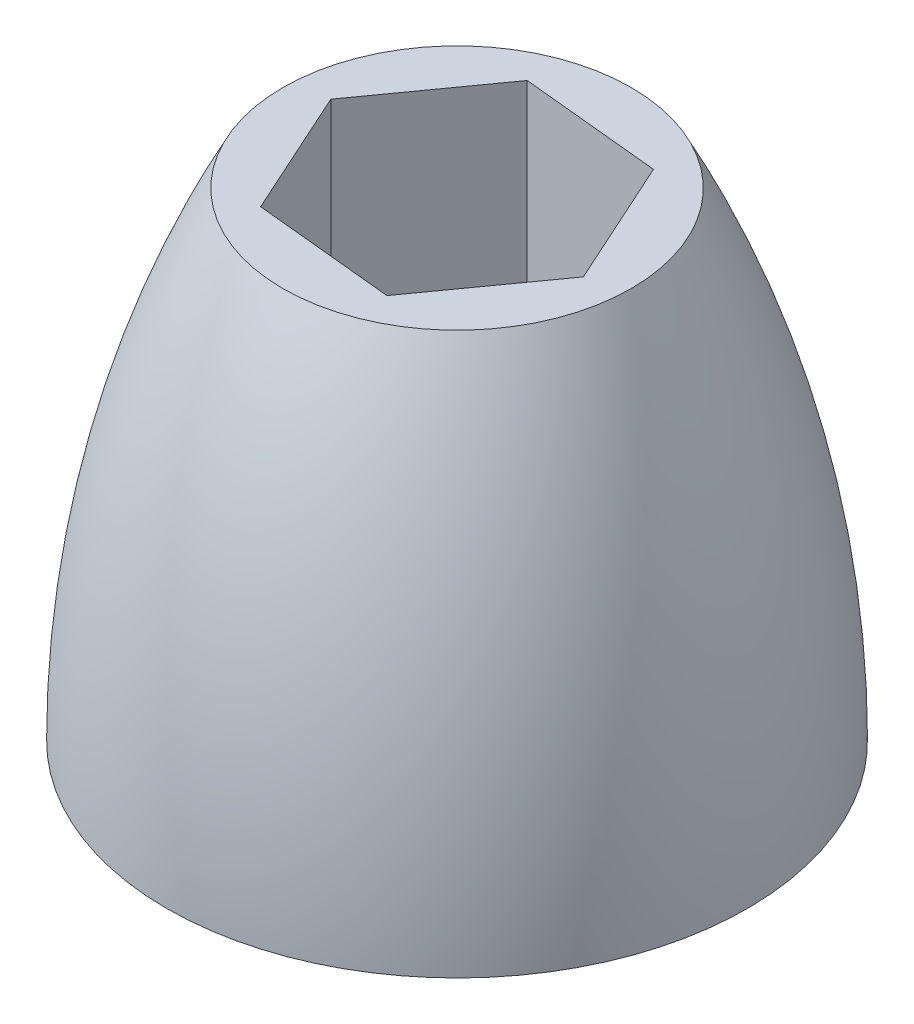
ISO-10303-21;
HEADER;
FILE_DESCRIPTION(('STEP AP214'),'2;1');
FILE_NAME('part.step','',(''),(''),'','','');
FILE_SCHEMA(('AUTOMOTIVE_DESIGN { 1 0 10303 214 1 1 1 1 }'));
ENDSEC;
DATA;
#1=APPLICATION_CONTEXT('core data for automotive mechanical design processes');
#2=APPLICATION_PROTOCOL_DEFINITION('international standard','automotive_design',2000,#1);
#3=PRODUCT_CONTEXT('',#1,'mechanical');
#4=PRODUCT('Part','Part','',(#3));
#5=PRODUCT_RELATED_PRODUCT_CATEGORY('part','',(#4));
#6=PRODUCT_DEFINITION_FORMATION('','',#4);
#7=PRODUCT_DEFINITION_CONTEXT('part definition',#1,'design');
#8=PRODUCT_DEFINITION('design','',#6,#7);
#9=PRODUCT_DEFINITION_SHAPE('','',#8);
#10=(LENGTH_UNIT() NAMED_UNIT(*) SI_UNIT(.MILLI.,.METRE.));
#11=(NAMED_UNIT(*) PLANE_ANGLE_UNIT() SI_UNIT($,.RADIAN.));
#12=(NAMED_UNIT(*) SI_UNIT($,.STERADIAN.) SOLID_ANGLE_UNIT());
#13=UNCERTAINTY_MEASURE_WITH_UNIT(LENGTH_MEASURE(1.E-05),#10,'distance_accuracy_value','');
#14=(GEOMETRIC_REPRESENTATION_CONTEXT(3) GLOBAL_UNCERTAINTY_ASSIGNED_CONTEXT((#13)) GLOBAL_UNIT_ASSIGNED_CONTEXT((#10,
#11,#12)) REPRESENTATION_CONTEXT('',''));
#15=CARTESIAN_POINT('',(0.,0.,0.));
#16=DIRECTION('',(0.,0.,1.));
#17=DIRECTION('',(1.,0.,0.));
#18=AXIS2_PLACEMENT_3D('',#15,#16,#17);
#19=CARTESIAN_POINT('',(0.,104.775,0.));
#20=DIRECTION('',(0.,1.,0.));
#21=DIRECTION('',(0.,0.,1.));
#22=AXIS2_PLACEMENT_3D('',#19,#20,#21);
#23=PLANE('',#22);
#24=DIRECTION('',(0.582558314438273,0.,-0.812788908806486));
#25=VECTOR('',#24,1.);
#26=CARTESIAN_POINT('',(-15.3236366613952,104.775,-1.510781079292));
#27=LINE('',#26,#25);
#28=CARTESIAN_POINT('',(-15.3236366613952,104.775,-1.510781079292));
#29=VERTEX_POINT('',#28);
#30=CARTESIAN_POINT('',(-6.35344353647385,104.775,-14.0260491667768));
#31=VERTEX_POINT('',#30);
#32=EDGE_CURVE('E140',#29,#31,#27,.T.);
#33=ORIENTED_EDGE('',*,*,#32,.T.);
#34=DIRECTION('',(0.995175000159787,0.,0.0981158450861447));
#35=VECTOR('',#34,1.);
#36=CARTESIAN_POINT('',(-6.35344353647385,104.775,-14.0260491667768));
#37=LINE('',#36,#35);
#38=CARTESIAN_POINT('',(8.97019312492135,104.775,-12.5152680874848));
#39=VERTEX_POINT('',#38);
#40=EDGE_CURVE('E123',#31,#39,#37,.T.);
#41=ORIENTED_EDGE('',*,*,#40,.T.);
#42=DIRECTION('',(0.412616685721513,0.,0.910904753892631));
#43=VECTOR('',#42,1.);
#44=CARTESIAN_POINT('',(8.97019312492135,104.775,-12.5152680874848));
#45=LINE('',#44,#43);
#46=CARTESIAN_POINT('',(15.3236366613952,104.775,1.510781079292));
#47=VERTEX_POINT('',#46);
#48=EDGE_CURVE('E132',#39,#47,#45,.T.);
#49=ORIENTED_EDGE('',*,*,#48,.T.);
#50=DIRECTION('',(-0.582558314438273,0.,0.812788908806486));
#51=VECTOR('',#50,1.);
#52=CARTESIAN_POINT('',(15.3236366613952,104.775,1.510781079292));
#53=LINE('',#52,#51);
#54=CARTESIAN_POINT('',(6.35344353647386,104.775,14.0260491667768));
#55=VERTEX_POINT('',#54);
#56=EDGE_CURVE('E127',#47,#55,#53,.T.);
#57=ORIENTED_EDGE('',*,*,#56,.T.);
#58=DIRECTION('',(-0.995175000159787,0.,-0.0981158450861446));
#59=VECTOR('',#58,1.);
#60=CARTESIAN_POINT('',(6.35344353647386,104.775,14.0260491667768));
#61=LINE('',#60,#59);
#62=CARTESIAN_POINT('',(-8.97019312492135,104.775,12.5152680874848));
#63=VERTEX_POINT('',#62);
#64=EDGE_CURVE('E115',#55,#63,#61,.T.);
#65=ORIENTED_EDGE('',*,*,#64,.T.);
#66=DIRECTION('',(-0.412616685721514,0.,-0.91090475389263));
#67=VECTOR('',#66,1.);
#68=CARTESIAN_POINT('',(-8.97019312492135,104.775,12.5152680874848));
#69=LINE('',#68,#67);
#70=EDGE_CURVE('E113',#63,#29,#69,.T.);
#71=ORIENTED_EDGE('',*,*,#70,.T.);
#72=EDGE_LOOP('',(#33,#41,#49,#57,#65,#71));
#73=FACE_BOUND('',#72,.T.);
#74=CARTESIAN_POINT('',(0.,104.775,0.));
#75=DIRECTION('',(0.,-1.,0.));
#76=DIRECTION('',(1.,0.,0.));
#77=AXIS2_PLACEMENT_3D('',#74,#75,#76);
#78=CIRCLE('',#77,19.05);
#79=CARTESIAN_POINT('',(19.05,104.775,0.));
#80=VERTEX_POINT('',#79);
#81=EDGE_CURVE('E149',#80,#80,#78,.T.);
#82=ORIENTED_EDGE('',*,*,#81,.F.);
#83=EDGE_LOOP('',(#82));
#84=FACE_BOUND('',#83,.T.);
#85=ADVANCED_FACE('F43',(#73,#84),#23,.T.);
#86=CARTESIAN_POINT('',(-15.3236366613952,146.322269260893,-1.510781079292));
#87=DIRECTION('',(-0.812788908806486,0.,-0.582558314438273));
#88=DIRECTION('',(-0.582558314438273,0.,0.812788908806486));
#89=AXIS2_PLACEMENT_3D('',#86,#87,#88);
#90=PLANE('',#89);
#91=DIRECTION('',(0.,-1.,0.));
#92=VECTOR('',#91,1.);
#93=CARTESIAN_POINT('',(-15.3236366613952,146.322269260893,-1.510781079292));
#94=LINE('',#93,#92);
#95=CARTESIAN_POINT('',(-15.3236366613952,52.3875,-1.510781079292));
#96=VERTEX_POINT('',#95);
#97=EDGE_CURVE('E51',#29,#96,#94,.T.);
#98=ORIENTED_EDGE('',*,*,#97,.T.);
#99=DIRECTION('',(0.582558314438273,0.,-0.812788908806486));
#100=VECTOR('',#99,1.);
#101=CARTESIAN_POINT('',(-15.3236366613952,52.3875,-1.510781079292));
#102=LINE('',#101,#100);
#103=CARTESIAN_POINT('',(-6.35344353647385,52.3875,-14.0260491667768));
#104=VERTEX_POINT('',#103);
#105=EDGE_CURVE('E58',#96,#104,#102,.T.);
#106=ORIENTED_EDGE('',*,*,#105,.T.);
#107=DIRECTION('',(0.,-1.,0.));
#108=VECTOR('',#107,1.);
#109=CARTESIAN_POINT('',(-6.35344353647385,146.322269260893,-14.0260491667768));
#110=LINE('',#109,#108);
#111=EDGE_CURVE('E137',#31,#104,#110,.T.);
#112=ORIENTED_EDGE('',*,*,#111,.F.);
#113=ORIENTED_EDGE('',*,*,#32,.F.);
#114=EDGE_LOOP('',(#98,#106,#112,#113));
#115=FACE_BOUND('',#114,.T.);
#116=ADVANCED_FACE('F143',(#115),#90,.F.);
#117=CARTESIAN_POINT('',(-6.35344353647385,146.322269260893,-14.0260491667768));
#118=DIRECTION('',(0.0981158450861447,0.,-0.995175000159787));
#119=DIRECTION('',(-0.995175000159787,0.,-0.0981158450861447));
#120=AXIS2_PLACEMENT_3D('',#117,#118,#119);
#121=PLANE('',#120);
#122=ORIENTED_EDGE('',*,*,#111,.T.);
#123=DIRECTION('',(0.995175000159787,0.,0.0981158450861447));
#124=VECTOR('',#123,1.);
#125=CARTESIAN_POINT('',(-6.35344353647385,52.3875,-14.0260491667768));
#126=LINE('',#125,#124);
#127=CARTESIAN_POINT('',(8.97019312492135,52.3875,-12.5152680874848));
#128=VERTEX_POINT('',#127);
#129=EDGE_CURVE('E162',#104,#128,#126,.T.);
#130=ORIENTED_EDGE('',*,*,#129,.T.);
#131=DIRECTION('',(0.,-1.,0.));
#132=VECTOR('',#131,1.);
#133=CARTESIAN_POINT('',(8.97019312492135,146.322269260893,-12.5152680874848));
#134=LINE('',#133,#132);
#135=EDGE_CURVE('E133',#39,#128,#134,.T.);
#136=ORIENTED_EDGE('',*,*,#135,.F.);
#137=ORIENTED_EDGE('',*,*,#40,.F.);
#138=EDGE_LOOP('',(#122,#130,#136,#137));
#139=FACE_BOUND('',#138,.T.);
#140=ADVANCED_FACE('F179',(#139),#121,.F.);
#141=CARTESIAN_POINT('',(8.97019312492135,146.322269260893,-12.5152680874848));
#142=DIRECTION('',(0.910904753892631,0.,-0.412616685721513));
#143=DIRECTION('',(-0.412616685721513,0.,-0.910904753892631));
#144=AXIS2_PLACEMENT_3D('',#141,#142,#143);
#145=PLANE('',#144);
#146=ORIENTED_EDGE('',*,*,#135,.T.);
#147=DIRECTION('',(0.412616685721513,0.,0.910904753892631));
#148=VECTOR('',#147,1.);
#149=CARTESIAN_POINT('',(8.97019312492135,52.3875,-12.5152680874848));
#150=LINE('',#149,#148);
#151=CARTESIAN_POINT('',(15.3236366613952,52.3875,1.510781079292));
#152=VERTEX_POINT('',#151);
#153=EDGE_CURVE('E159',#128,#152,#150,.T.);
#154=ORIENTED_EDGE('',*,*,#153,.T.);
#155=DIRECTION('',(0.,-1.,0.));
#156=VECTOR('',#155,1.);
#157=CARTESIAN_POINT('',(15.3236366613952,146.322269260893,1.510781079292));
#158=LINE('',#157,#156);
#159=EDGE_CURVE('E128',#47,#152,#158,.T.);
#160=ORIENTED_EDGE('',*,*,#159,.F.);
#161=ORIENTED_EDGE('',*,*,#48,.F.);
#162=EDGE_LOOP('',(#146,#154,#160,#161));
#163=FACE_BOUND('',#162,.T.);
#164=ADVANCED_FACE('F177',(#163),#145,.F.);
#165=CARTESIAN_POINT('',(15.3236366613952,146.322269260893,1.510781079292));
#166=DIRECTION('',(0.812788908806486,0.,0.582558314438273));
#167=DIRECTION('',(0.582558314438273,0.,-0.812788908806486));
#168=AXIS2_PLACEMENT_3D('',#165,#166,#167);
#169=PLANE('',#168);
#170=ORIENTED_EDGE('',*,*,#159,.T.);
#171=DIRECTION('',(-0.582558314438273,0.,0.812788908806486));
#172=VECTOR('',#171,1.);
#173=CARTESIAN_POINT('',(15.3236366613952,52.3875,1.510781079292));
#174=LINE('',#173,#172);
#175=CARTESIAN_POINT('',(6.35344353647386,52.3875,14.0260491667768));
#176=VERTEX_POINT('',#175);
#177=EDGE_CURVE('E109',#152,#176,#174,.T.);
#178=ORIENTED_EDGE('',*,*,#177,.T.);
#179=DIRECTION('',(0.,-1.,0.));
#180=VECTOR('',#179,1.);
#181=CARTESIAN_POINT('',(6.35344353647386,146.322269260893,14.0260491667768));
#182=LINE('',#181,#180);
#183=EDGE_CURVE('E107',#55,#176,#182,.T.);
#184=ORIENTED_EDGE('',*,*,#183,.F.);
#185=ORIENTED_EDGE('',*,*,#56,.F.);
#186=EDGE_LOOP('',(#170,#178,#184,#185));
#187=FACE_BOUND('',#186,.T.);
#188=ADVANCED_FACE('F155',(#187),#169,.F.);
#189=CARTESIAN_POINT('',(6.35344353647386,146.322269260893,14.0260491667768));
#190=DIRECTION('',(-0.0981158450861446,0.,0.995175000159787));
#191=DIRECTION('',(0.995175000159787,0.,0.0981158450861446));
#192=AXIS2_PLACEMENT_3D('',#189,#190,#191);
#193=PLANE('',#192);
#194=ORIENTED_EDGE('',*,*,#183,.T.);
#195=DIRECTION('',(-0.995175000159787,0.,-0.0981158450861446));
#196=VECTOR('',#195,1.);
#197=CARTESIAN_POINT('',(6.35344353647386,52.3875,14.0260491667768));
#198=LINE('',#197,#196);
#199=CARTESIAN_POINT('',(-8.97019312492135,52.3875,12.5152680874848));
#200=VERTEX_POINT('',#199);
#201=EDGE_CURVE('E95',#176,#200,#198,.T.);
#202=ORIENTED_EDGE('',*,*,#201,.T.);
#203=DIRECTION('',(0.,-1.,0.));
#204=VECTOR('',#203,1.);
#205=CARTESIAN_POINT('',(-8.97019312492135,146.322269260893,12.5152680874848));
#206=LINE('',#205,#204);
#207=EDGE_CURVE('E104',#63,#200,#206,.T.);
#208=ORIENTED_EDGE('',*,*,#207,.F.);
#209=ORIENTED_EDGE('',*,*,#64,.F.);
#210=EDGE_LOOP('',(#194,#202,#208,#209));
#211=FACE_BOUND('',#210,.T.);
#212=ADVANCED_FACE('F103',(#211),#193,.F.);
#213=CARTESIAN_POINT('',(-8.97019312492135,146.322269260893,12.5152680874848));
#214=DIRECTION('',(-0.91090475389263,0.,0.412616685721514));
#215=DIRECTION('',(0.412616685721514,0.,0.91090475389263));
#216=AXIS2_PLACEMENT_3D('',#213,#214,#215);
#217=PLANE('',#216);
#218=ORIENTED_EDGE('',*,*,#207,.T.);
#219=DIRECTION('',(-0.412616685721514,0.,-0.91090475389263));
#220=VECTOR('',#219,1.);
#221=CARTESIAN_POINT('',(-8.97019312492135,52.3875,12.5152680874848));
#222=LINE('',#221,#220);
#223=EDGE_CURVE('E92',#200,#96,#222,.T.);
#224=ORIENTED_EDGE('',*,*,#223,.T.);
#225=ORIENTED_EDGE('',*,*,#97,.F.);
#226=ORIENTED_EDGE('',*,*,#70,.F.);
#227=EDGE_LOOP('',(#218,#224,#225,#226));
#228=FACE_BOUND('',#227,.T.);
#229=ADVANCED_FACE('F111',(#228),#217,.F.);
#230=CARTESIAN_POINT('',(0.,52.3875,0.));
#231=DIRECTION('',(0.,-1.,0.));
#232=DIRECTION('',(1.,0.,0.));
#233=AXIS2_PLACEMENT_3D('',#230,#231,#232);
#234=DEGENERATE_TOROIDAL_SURFACE('',#233,82.6492187500001,114.39921875,.F.);
#235=CARTESIAN_POINT('',(0.,52.3875,0.));
#236=DIRECTION('',(0.,1.,0.));
#237=DIRECTION('',(0.,0.,1.));
#238=AXIS2_PLACEMENT_3D('',#235,#236,#237);
#239=CIRCLE('',#238,31.75);
#240=CARTESIAN_POINT('',(0.,52.3875,31.75));
#241=VERTEX_POINT('',#240);
#242=EDGE_CURVE('E11',#241,#241,#239,.T.);
#243=ORIENTED_EDGE('',*,*,#242,.T.);
#244=EDGE_LOOP('',(#243));
#245=FACE_BOUND('',#244,.T.);
#246=ORIENTED_EDGE('',*,*,#81,.T.);
#247=EDGE_LOOP('',(#246));
#248=FACE_BOUND('',#247,.T.);
#249=ADVANCED_FACE('F230',(#245,#248),#234,.F.);
#250=CARTESIAN_POINT('',(-39.6693454649985,52.3875,-31.75));
#251=DIRECTION('',(0.,1.,0.));
#252=DIRECTION('',(0.,0.,1.));
#253=AXIS2_PLACEMENT_3D('',#250,#251,#252);
#254=PLANE('',#253);
#255=ORIENTED_EDGE('',*,*,#242,.F.);
#256=EDGE_LOOP('',(#255));
#257=FACE_BOUND('',#256,.T.);
#258=ORIENTED_EDGE('',*,*,#223,.F.);
#259=ORIENTED_EDGE('',*,*,#201,.F.);
#260=ORIENTED_EDGE('',*,*,#177,.F.);
#261=ORIENTED_EDGE('',*,*,#153,.F.);
#262=ORIENTED_EDGE('',*,*,#129,.F.);
#263=ORIENTED_EDGE('',*,*,#105,.F.);
#264=EDGE_LOOP('',(#258,#259,#260,#261,#262,#263));
#265=FACE_BOUND('',#264,.T.);
#266=ADVANCED_FACE('F94',(#257,#265),#254,.F.);
#267=CLOSED_SHELL('',(#85,#116,#140,#164,#188,#212,#229,#249,#266));
#268=MANIFOLD_SOLID_BREP('B2',#267);
#269=ADVANCED_BREP_SHAPE_REPRESENTATION('',(#18,#268),#14);
#270=SHAPE_DEFINITION_REPRESENTATION(#9,#269);
ENDSEC;
END-ISO-10303-21;
